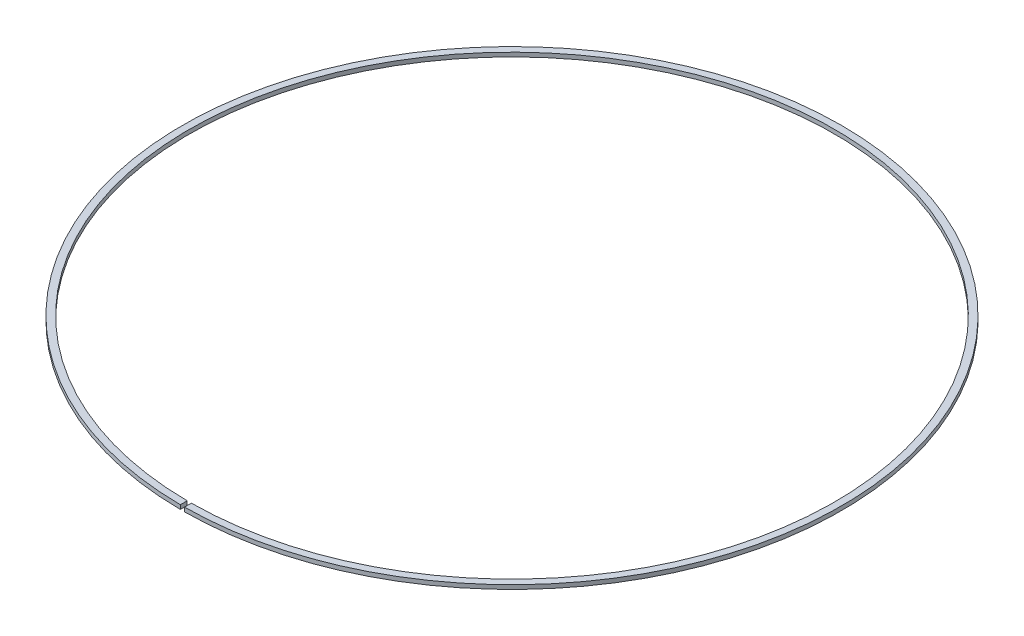
ISO-10303-21;
HEADER;
FILE_DESCRIPTION(('STEP AP214'),'2;1');
FILE_NAME('part.step','',(''),(''),'','','');
FILE_SCHEMA(('AUTOMOTIVE_DESIGN { 1 0 10303 214 1 1 1 1 }'));
ENDSEC;
DATA;
#1=APPLICATION_CONTEXT('core data for automotive mechanical design processes');
#2=APPLICATION_PROTOCOL_DEFINITION('international standard','automotive_design',2000,#1);
#3=PRODUCT_CONTEXT('',#1,'mechanical');
#4=PRODUCT('Part','Part','',(#3));
#5=PRODUCT_RELATED_PRODUCT_CATEGORY('part','',(#4));
#6=PRODUCT_DEFINITION_FORMATION('','',#4);
#7=PRODUCT_DEFINITION_CONTEXT('part definition',#1,'design');
#8=PRODUCT_DEFINITION('design','',#6,#7);
#9=PRODUCT_DEFINITION_SHAPE('','',#8);
#10=(LENGTH_UNIT() NAMED_UNIT(*) SI_UNIT(.MILLI.,.METRE.));
#11=(NAMED_UNIT(*) PLANE_ANGLE_UNIT() SI_UNIT($,.RADIAN.));
#12=(NAMED_UNIT(*) SI_UNIT($,.STERADIAN.) SOLID_ANGLE_UNIT());
#13=UNCERTAINTY_MEASURE_WITH_UNIT(LENGTH_MEASURE(1.E-05),#10,'distance_accuracy_value','');
#14=(GEOMETRIC_REPRESENTATION_CONTEXT(3) GLOBAL_UNCERTAINTY_ASSIGNED_CONTEXT((#13)) GLOBAL_UNIT_ASSIGNED_CONTEXT((#10,
#11,#12)) REPRESENTATION_CONTEXT('',''));
#15=CARTESIAN_POINT('',(0.,0.,0.));
#16=DIRECTION('',(0.,0.,1.));
#17=DIRECTION('',(1.,0.,0.));
#18=AXIS2_PLACEMENT_3D('',#15,#16,#17);
#19=CARTESIAN_POINT('',(0.,3.,0.));
#20=DIRECTION('',(0.,1.,0.));
#21=DIRECTION('',(0.,0.,1.));
#22=AXIS2_PLACEMENT_3D('',#19,#20,#21);
#23=PLANE('',#22);
#24=DIRECTION('',(0.,0.,-1.));
#25=VECTOR('',#24,1.);
#26=CARTESIAN_POINT('',(1.50000000000075,3.,240.600507199693));
#27=LINE('',#26,#25);
#28=CARTESIAN_POINT('',(1.50000000000075,3.,239.995312454223));
#29=VERTEX_POINT('',#28);
#30=CARTESIAN_POINT('',(1.50000000000075,3.,234.995212717196));
#31=VERTEX_POINT('',#30);
#32=EDGE_CURVE('E55',#29,#31,#27,.T.);
#33=ORIENTED_EDGE('',*,*,#32,.F.);
#34=CARTESIAN_POINT('',(0.,3.,0.));
#35=DIRECTION('',(0.,1.,0.));
#36=DIRECTION('',(0.,0.,1.));
#37=AXIS2_PLACEMENT_3D('',#34,#35,#36);
#38=CIRCLE('',#37,240.);
#39=CARTESIAN_POINT('',(-1.49999999999991,3.,239.995312454223));
#40=VERTEX_POINT('',#39);
#41=EDGE_CURVE('E86',#29,#40,#38,.T.);
#42=ORIENTED_EDGE('',*,*,#41,.T.);
#43=DIRECTION('',(0.,0.,1.));
#44=VECTOR('',#43,1.);
#45=CARTESIAN_POINT('',(-1.49999999999991,3.,234.071176680922));
#46=LINE('',#45,#44);
#47=CARTESIAN_POINT('',(-1.49999999999991,3.,234.995212717196));
#48=VERTEX_POINT('',#47);
#49=EDGE_CURVE('E89',#48,#40,#46,.T.);
#50=ORIENTED_EDGE('',*,*,#49,.F.);
#51=CARTESIAN_POINT('',(0.,3.,0.));
#52=DIRECTION('',(0.,1.,0.));
#53=DIRECTION('',(0.,0.,1.));
#54=AXIS2_PLACEMENT_3D('',#51,#52,#53);
#55=CIRCLE('',#54,235.);
#56=EDGE_CURVE('E88',#31,#48,#55,.T.);
#57=ORIENTED_EDGE('',*,*,#56,.F.);
#58=EDGE_LOOP('',(#33,#42,#50,#57));
#59=FACE_BOUND('',#58,.T.);
#60=ADVANCED_FACE('F33',(#59),#23,.T.);
#61=CARTESIAN_POINT('',(0.,0.,0.));
#62=DIRECTION('',(0.,1.,0.));
#63=DIRECTION('',(0.,0.,1.));
#64=AXIS2_PLACEMENT_3D('',#61,#62,#63);
#65=PLANE('',#64);
#66=CARTESIAN_POINT('',(0.,0.,0.));
#67=DIRECTION('',(0.,1.,0.));
#68=DIRECTION('',(0.,0.,1.));
#69=AXIS2_PLACEMENT_3D('',#66,#67,#68);
#70=CIRCLE('',#69,240.);
#71=CARTESIAN_POINT('',(1.50000000000075,0.,239.995312454223));
#72=VERTEX_POINT('',#71);
#73=CARTESIAN_POINT('',(-1.49999999999991,0.,239.995312454223));
#74=VERTEX_POINT('',#73);
#75=EDGE_CURVE('E92',#72,#74,#70,.T.);
#76=ORIENTED_EDGE('',*,*,#75,.F.);
#77=DIRECTION('',(0.,0.,-1.));
#78=VECTOR('',#77,1.);
#79=CARTESIAN_POINT('',(1.50000000000075,0.,240.600507199693));
#80=LINE('',#79,#78);
#81=CARTESIAN_POINT('',(1.50000000000075,0.,234.995212717196));
#82=VERTEX_POINT('',#81);
#83=EDGE_CURVE('E74',#72,#82,#80,.T.);
#84=ORIENTED_EDGE('',*,*,#83,.T.);
#85=CARTESIAN_POINT('',(0.,0.,0.));
#86=DIRECTION('',(0.,1.,0.));
#87=DIRECTION('',(0.,0.,1.));
#88=AXIS2_PLACEMENT_3D('',#85,#86,#87);
#89=CIRCLE('',#88,235.);
#90=CARTESIAN_POINT('',(-1.49999999999991,0.,234.995212717196));
#91=VERTEX_POINT('',#90);
#92=EDGE_CURVE('E79',#82,#91,#89,.T.);
#93=ORIENTED_EDGE('',*,*,#92,.T.);
#94=DIRECTION('',(0.,0.,1.));
#95=VECTOR('',#94,1.);
#96=CARTESIAN_POINT('',(-1.49999999999991,0.,234.071176680922));
#97=LINE('',#96,#95);
#98=EDGE_CURVE('E48',#91,#74,#97,.T.);
#99=ORIENTED_EDGE('',*,*,#98,.T.);
#100=EDGE_LOOP('',(#76,#84,#93,#99));
#101=FACE_BOUND('',#100,.T.);
#102=ADVANCED_FACE('F104',(#101),#65,.F.);
#103=CARTESIAN_POINT('',(0.,3.,0.));
#104=DIRECTION('',(0.,-1.,0.));
#105=DIRECTION('',(0.,0.,-1.));
#106=AXIS2_PLACEMENT_3D('',#103,#104,#105);
#107=CYLINDRICAL_SURFACE('',#106,240.);
#108=ORIENTED_EDGE('',*,*,#41,.F.);
#109=DIRECTION('',(0.,-1.,0.));
#110=VECTOR('',#109,1.);
#111=CARTESIAN_POINT('',(1.50000000000075,3.,239.995312454223));
#112=LINE('',#111,#110);
#113=EDGE_CURVE('E71',#29,#72,#112,.T.);
#114=ORIENTED_EDGE('',*,*,#113,.T.);
#115=ORIENTED_EDGE('',*,*,#75,.T.);
#116=DIRECTION('',(0.,-1.,0.));
#117=VECTOR('',#116,1.);
#118=CARTESIAN_POINT('',(-1.49999999999991,3.,239.995312454223));
#119=LINE('',#118,#117);
#120=EDGE_CURVE('E80',#74,#40,#119,.F.);
#121=ORIENTED_EDGE('',*,*,#120,.T.);
#122=EDGE_LOOP('',(#108,#114,#115,#121));
#123=FACE_BOUND('',#122,.T.);
#124=ADVANCED_FACE('F35',(#123),#107,.T.);
#125=CARTESIAN_POINT('',(0.,3.,0.));
#126=DIRECTION('',(0.,-1.,0.));
#127=DIRECTION('',(0.,0.,-1.));
#128=AXIS2_PLACEMENT_3D('',#125,#126,#127);
#129=CYLINDRICAL_SURFACE('',#128,235.);
#130=DIRECTION('',(0.,-1.,0.));
#131=VECTOR('',#130,1.);
#132=CARTESIAN_POINT('',(1.50000000000075,3.,234.995212717196));
#133=LINE('',#132,#131);
#134=EDGE_CURVE('E11',#31,#82,#133,.T.);
#135=ORIENTED_EDGE('',*,*,#134,.F.);
#136=ORIENTED_EDGE('',*,*,#56,.T.);
#137=DIRECTION('',(0.,-1.,0.));
#138=VECTOR('',#137,1.);
#139=CARTESIAN_POINT('',(-1.49999999999991,3.,234.995212717196));
#140=LINE('',#139,#138);
#141=EDGE_CURVE('E41',#91,#48,#140,.F.);
#142=ORIENTED_EDGE('',*,*,#141,.F.);
#143=ORIENTED_EDGE('',*,*,#92,.F.);
#144=EDGE_LOOP('',(#135,#136,#142,#143));
#145=FACE_BOUND('',#144,.T.);
#146=ADVANCED_FACE('F106',(#145),#129,.F.);
#147=CARTESIAN_POINT('',(-1.49999999999991,0.,234.071176680922));
#148=DIRECTION('',(-1.,0.,0.));
#149=DIRECTION('',(0.,0.,1.));
#150=AXIS2_PLACEMENT_3D('',#147,#148,#149);
#151=PLANE('',#150);
#152=ORIENTED_EDGE('',*,*,#98,.F.);
#153=ORIENTED_EDGE('',*,*,#141,.T.);
#154=ORIENTED_EDGE('',*,*,#49,.T.);
#155=ORIENTED_EDGE('',*,*,#120,.F.);
#156=EDGE_LOOP('',(#152,#153,#154,#155));
#157=FACE_BOUND('',#156,.T.);
#158=ADVANCED_FACE('F107',(#157),#151,.F.);
#159=CARTESIAN_POINT('',(1.50000000000075,0.,240.600507199693));
#160=DIRECTION('',(1.,0.,0.));
#161=DIRECTION('',(0.,0.,-1.));
#162=AXIS2_PLACEMENT_3D('',#159,#160,#161);
#163=PLANE('',#162);
#164=ORIENTED_EDGE('',*,*,#32,.T.);
#165=ORIENTED_EDGE('',*,*,#134,.T.);
#166=ORIENTED_EDGE('',*,*,#83,.F.);
#167=ORIENTED_EDGE('',*,*,#113,.F.);
#168=EDGE_LOOP('',(#164,#165,#166,#167));
#169=FACE_BOUND('',#168,.T.);
#170=ADVANCED_FACE('F72',(#169),#163,.F.);
#171=CLOSED_SHELL('',(#60,#102,#124,#146,#158,#170));
#172=MANIFOLD_SOLID_BREP('B2',#171);
#173=ADVANCED_BREP_SHAPE_REPRESENTATION('',(#18,#172),#14);
#174=SHAPE_DEFINITION_REPRESENTATION(#9,#173);
ENDSEC;
END-ISO-10303-21;
